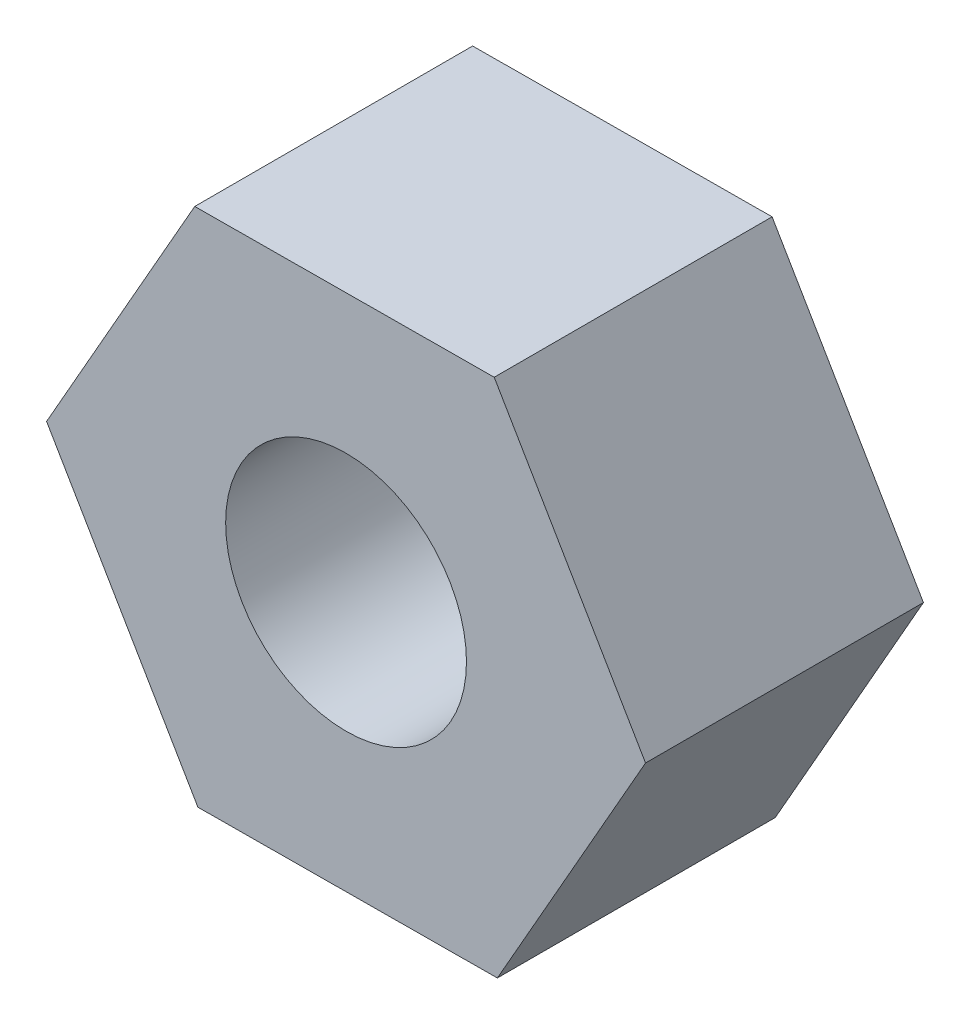
ISO-10303-21;
HEADER;
FILE_DESCRIPTION(('STEP AP214'),'2;1');
FILE_NAME('part.step','',(''),(''),'','','');
FILE_SCHEMA(('AUTOMOTIVE_DESIGN { 1 0 10303 214 1 1 1 1 }'));
ENDSEC;
DATA;
#1=APPLICATION_CONTEXT('core data for automotive mechanical design processes');
#2=APPLICATION_PROTOCOL_DEFINITION('international standard','automotive_design',2000,#1);
#3=PRODUCT_CONTEXT('',#1,'mechanical');
#4=PRODUCT('Part','Part','',(#3));
#5=PRODUCT_RELATED_PRODUCT_CATEGORY('part','',(#4));
#6=PRODUCT_DEFINITION_FORMATION('','',#4);
#7=PRODUCT_DEFINITION_CONTEXT('part definition',#1,'design');
#8=PRODUCT_DEFINITION('design','',#6,#7);
#9=PRODUCT_DEFINITION_SHAPE('','',#8);
#10=(LENGTH_UNIT() NAMED_UNIT(*) SI_UNIT(.MILLI.,.METRE.));
#11=(NAMED_UNIT(*) PLANE_ANGLE_UNIT() SI_UNIT($,.RADIAN.));
#12=(NAMED_UNIT(*) SI_UNIT($,.STERADIAN.) SOLID_ANGLE_UNIT());
#13=UNCERTAINTY_MEASURE_WITH_UNIT(LENGTH_MEASURE(1.E-05),#10,'distance_accuracy_value','');
#14=(GEOMETRIC_REPRESENTATION_CONTEXT(3) GLOBAL_UNCERTAINTY_ASSIGNED_CONTEXT((#13)) GLOBAL_UNIT_ASSIGNED_CONTEXT((#10,
#11,#12)) REPRESENTATION_CONTEXT('',''));
#15=CARTESIAN_POINT('',(0.,0.,0.));
#16=DIRECTION('',(0.,0.,1.));
#17=DIRECTION('',(1.,0.,0.));
#18=AXIS2_PLACEMENT_3D('',#15,#16,#17);
#19=CARTESIAN_POINT('',(0.,0.,15.));
#20=DIRECTION('',(0.,0.,1.));
#21=DIRECTION('',(1.,0.,0.));
#22=AXIS2_PLACEMENT_3D('',#19,#20,#21);
#23=PLANE('',#22);
#24=DIRECTION('',(0.999981476716129,0.00608656098549651,0.));
#25=VECTOR('',#24,1.);
#26=CARTESIAN_POINT('',(-7.99754219293679,-14.0489377607536,15.));
#27=LINE('',#26,#25);
#28=CARTESIAN_POINT('',(-7.99754219293679,-14.0489377607536,15.));
#29=VERTEX_POINT('',#28);
#30=CARTESIAN_POINT('',(8.1679659005307,-13.950543587298,15.));
#31=VERTEX_POINT('',#30);
#32=EDGE_CURVE('E131',#29,#31,#27,.T.);
#33=ORIENTED_EDGE('',*,*,#32,.T.);
#34=DIRECTION('',(0.494719621922941,0.869052642642793,0.));
#35=VECTOR('',#34,1.);
#36=CARTESIAN_POINT('',(8.1679659005307,-13.950543587298,15.));
#37=LINE('',#36,#35);
#38=CARTESIAN_POINT('',(16.1655080934675,0.0983941734556353,15.));
#39=VERTEX_POINT('',#38);
#40=EDGE_CURVE('E89',#31,#39,#37,.T.);
#41=ORIENTED_EDGE('',*,*,#40,.T.);
#42=DIRECTION('',(-0.505261854793188,0.862966081657296,0.));
#43=VECTOR('',#42,1.);
#44=CARTESIAN_POINT('',(16.1655080934675,0.0983941734556353,15.));
#45=LINE('',#44,#43);
#46=CARTESIAN_POINT('',(7.9975421929368,14.0489377607536,15.));
#47=VERTEX_POINT('',#46);
#48=EDGE_CURVE('E102',#39,#47,#45,.T.);
#49=ORIENTED_EDGE('',*,*,#48,.T.);
#50=DIRECTION('',(-0.999981476716129,-0.00608656098549619,0.));
#51=VECTOR('',#50,1.);
#52=CARTESIAN_POINT('',(7.9975421929368,14.0489377607536,15.));
#53=LINE('',#52,#51);
#54=CARTESIAN_POINT('',(-8.1679659005307,13.950543587298,15.));
#55=VERTEX_POINT('',#54);
#56=EDGE_CURVE('E96',#47,#55,#53,.T.);
#57=ORIENTED_EDGE('',*,*,#56,.T.);
#58=DIRECTION('',(-0.494719621922941,-0.869052642642793,0.));
#59=VECTOR('',#58,1.);
#60=CARTESIAN_POINT('',(-8.1679659005307,13.950543587298,15.));
#61=LINE('',#60,#59);
#62=CARTESIAN_POINT('',(-16.1655080934675,-0.0983941734556334,15.));
#63=VERTEX_POINT('',#62);
#64=EDGE_CURVE('E100',#55,#63,#61,.T.);
#65=ORIENTED_EDGE('',*,*,#64,.T.);
#66=DIRECTION('',(0.505261854793187,-0.862966081657297,0.));
#67=VECTOR('',#66,1.);
#68=CARTESIAN_POINT('',(-16.1655080934675,-0.0983941734556334,15.));
#69=LINE('',#68,#67);
#70=EDGE_CURVE('E52',#63,#29,#69,.T.);
#71=ORIENTED_EDGE('',*,*,#70,.T.);
#72=EDGE_LOOP('',(#33,#41,#49,#57,#65,#71));
#73=FACE_BOUND('',#72,.T.);
#74=CARTESIAN_POINT('',(0.,0.,15.));
#75=DIRECTION('',(0.,0.,1.));
#76=DIRECTION('',(1.,0.,0.));
#77=AXIS2_PLACEMENT_3D('',#74,#75,#76);
#78=CIRCLE('',#77,6.5);
#79=CARTESIAN_POINT('',(6.5,0.,15.));
#80=VERTEX_POINT('',#79);
#81=EDGE_CURVE('E124',#80,#80,#78,.T.);
#82=ORIENTED_EDGE('',*,*,#81,.F.);
#83=EDGE_LOOP('',(#82));
#84=FACE_BOUND('',#83,.T.);
#85=ADVANCED_FACE('F35',(#73,#84),#23,.T.);
#86=CARTESIAN_POINT('',(0.,0.,0.));
#87=DIRECTION('',(0.,0.,1.));
#88=DIRECTION('',(1.,0.,0.));
#89=AXIS2_PLACEMENT_3D('',#86,#87,#88);
#90=PLANE('',#89);
#91=DIRECTION('',(0.999981476716129,0.00608656098549651,0.));
#92=VECTOR('',#91,1.);
#93=CARTESIAN_POINT('',(-7.99754219293679,-14.0489377607536,0.));
#94=LINE('',#93,#92);
#95=CARTESIAN_POINT('',(-7.99754219293679,-14.0489377607536,0.));
#96=VERTEX_POINT('',#95);
#97=CARTESIAN_POINT('',(8.1679659005307,-13.950543587298,0.));
#98=VERTEX_POINT('',#97);
#99=EDGE_CURVE('E120',#96,#98,#94,.T.);
#100=ORIENTED_EDGE('',*,*,#99,.F.);
#101=DIRECTION('',(0.505261854793187,-0.862966081657297,0.));
#102=VECTOR('',#101,1.);
#103=CARTESIAN_POINT('',(-16.1655080934675,-0.0983941734556334,0.));
#104=LINE('',#103,#102);
#105=CARTESIAN_POINT('',(-16.1655080934675,-0.0983941734556334,0.));
#106=VERTEX_POINT('',#105);
#107=EDGE_CURVE('E81',#106,#96,#104,.T.);
#108=ORIENTED_EDGE('',*,*,#107,.F.);
#109=DIRECTION('',(-0.494719621922941,-0.869052642642793,0.));
#110=VECTOR('',#109,1.);
#111=CARTESIAN_POINT('',(-8.1679659005307,13.950543587298,0.));
#112=LINE('',#111,#110);
#113=CARTESIAN_POINT('',(-8.1679659005307,13.950543587298,0.));
#114=VERTEX_POINT('',#113);
#115=EDGE_CURVE('E75',#114,#106,#112,.T.);
#116=ORIENTED_EDGE('',*,*,#115,.F.);
#117=DIRECTION('',(-0.999981476716129,-0.00608656098549619,0.));
#118=VECTOR('',#117,1.);
#119=CARTESIAN_POINT('',(7.9975421929368,14.0489377607536,0.));
#120=LINE('',#119,#118);
#121=CARTESIAN_POINT('',(7.9975421929368,14.0489377607536,0.));
#122=VERTEX_POINT('',#121);
#123=EDGE_CURVE('E110',#122,#114,#120,.T.);
#124=ORIENTED_EDGE('',*,*,#123,.F.);
#125=DIRECTION('',(-0.505261854793188,0.862966081657296,0.));
#126=VECTOR('',#125,1.);
#127=CARTESIAN_POINT('',(16.1655080934675,0.0983941734556353,0.));
#128=LINE('',#127,#126);
#129=CARTESIAN_POINT('',(16.1655080934675,0.0983941734556353,0.));
#130=VERTEX_POINT('',#129);
#131=EDGE_CURVE('E126',#130,#122,#128,.T.);
#132=ORIENTED_EDGE('',*,*,#131,.F.);
#133=DIRECTION('',(0.494719621922941,0.869052642642793,0.));
#134=VECTOR('',#133,1.);
#135=CARTESIAN_POINT('',(8.1679659005307,-13.950543587298,0.));
#136=LINE('',#135,#134);
#137=EDGE_CURVE('E123',#98,#130,#136,.T.);
#138=ORIENTED_EDGE('',*,*,#137,.F.);
#139=EDGE_LOOP('',(#100,#108,#116,#124,#132,#138));
#140=FACE_BOUND('',#139,.T.);
#141=CARTESIAN_POINT('',(0.,0.,0.));
#142=DIRECTION('',(0.,0.,1.));
#143=DIRECTION('',(1.,0.,0.));
#144=AXIS2_PLACEMENT_3D('',#141,#142,#143);
#145=CIRCLE('',#144,6.5);
#146=CARTESIAN_POINT('',(6.5,0.,0.));
#147=VERTEX_POINT('',#146);
#148=EDGE_CURVE('E224',#147,#147,#145,.T.);
#149=ORIENTED_EDGE('',*,*,#148,.T.);
#150=EDGE_LOOP('',(#149));
#151=FACE_BOUND('',#150,.T.);
#152=ADVANCED_FACE('F140',(#140,#151),#90,.F.);
#153=CARTESIAN_POINT('',(-7.99754219293679,-14.0489377607536,15.));
#154=DIRECTION('',(-0.00608656098549651,0.999981476716129,0.));
#155=DIRECTION('',(-0.999981476716129,-0.00608656098549651,0.));
#156=AXIS2_PLACEMENT_3D('',#153,#154,#155);
#157=PLANE('',#156);
#158=ORIENTED_EDGE('',*,*,#99,.T.);
#159=DIRECTION('',(0.,0.,-1.));
#160=VECTOR('',#159,1.);
#161=CARTESIAN_POINT('',(8.1679659005307,-13.950543587298,15.));
#162=LINE('',#161,#160);
#163=EDGE_CURVE('E11',#31,#98,#162,.T.);
#164=ORIENTED_EDGE('',*,*,#163,.F.);
#165=ORIENTED_EDGE('',*,*,#32,.F.);
#166=DIRECTION('',(0.,0.,-1.));
#167=VECTOR('',#166,1.);
#168=CARTESIAN_POINT('',(-7.99754219293679,-14.0489377607536,15.));
#169=LINE('',#168,#167);
#170=EDGE_CURVE('E116',#29,#96,#169,.T.);
#171=ORIENTED_EDGE('',*,*,#170,.T.);
#172=EDGE_LOOP('',(#158,#164,#165,#171));
#173=FACE_BOUND('',#172,.T.);
#174=ADVANCED_FACE('F37',(#173),#157,.F.);
#175=CARTESIAN_POINT('',(8.1679659005307,-13.950543587298,15.));
#176=DIRECTION('',(-0.869052642642793,0.494719621922941,0.));
#177=DIRECTION('',(-0.494719621922941,-0.869052642642793,0.));
#178=AXIS2_PLACEMENT_3D('',#175,#176,#177);
#179=PLANE('',#178);
#180=ORIENTED_EDGE('',*,*,#137,.T.);
#181=DIRECTION('',(0.,0.,-1.));
#182=VECTOR('',#181,1.);
#183=CARTESIAN_POINT('',(16.1655080934675,0.0983941734556353,15.));
#184=LINE('',#183,#182);
#185=EDGE_CURVE('E44',#39,#130,#184,.T.);
#186=ORIENTED_EDGE('',*,*,#185,.F.);
#187=ORIENTED_EDGE('',*,*,#40,.F.);
#188=ORIENTED_EDGE('',*,*,#163,.T.);
#189=EDGE_LOOP('',(#180,#186,#187,#188));
#190=FACE_BOUND('',#189,.T.);
#191=ADVANCED_FACE('F165',(#190),#179,.F.);
#192=CARTESIAN_POINT('',(16.1655080934675,0.0983941734556353,15.));
#193=DIRECTION('',(-0.862966081657297,-0.505261854793188,0.));
#194=DIRECTION('',(0.505261854793188,-0.862966081657297,0.));
#195=AXIS2_PLACEMENT_3D('',#192,#193,#194);
#196=PLANE('',#195);
#197=ORIENTED_EDGE('',*,*,#131,.T.);
#198=DIRECTION('',(0.,0.,-1.));
#199=VECTOR('',#198,1.);
#200=CARTESIAN_POINT('',(7.9975421929368,14.0489377607536,15.));
#201=LINE('',#200,#199);
#202=EDGE_CURVE('E111',#47,#122,#201,.T.);
#203=ORIENTED_EDGE('',*,*,#202,.F.);
#204=ORIENTED_EDGE('',*,*,#48,.F.);
#205=ORIENTED_EDGE('',*,*,#185,.T.);
#206=EDGE_LOOP('',(#197,#203,#204,#205));
#207=FACE_BOUND('',#206,.T.);
#208=ADVANCED_FACE('F137',(#207),#196,.F.);
#209=CARTESIAN_POINT('',(7.9975421929368,14.0489377607536,15.));
#210=DIRECTION('',(0.00608656098549619,-0.999981476716129,0.));
#211=DIRECTION('',(0.999981476716129,0.00608656098549619,0.));
#212=AXIS2_PLACEMENT_3D('',#209,#210,#211);
#213=PLANE('',#212);
#214=ORIENTED_EDGE('',*,*,#123,.T.);
#215=DIRECTION('',(0.,0.,-1.));
#216=VECTOR('',#215,1.);
#217=CARTESIAN_POINT('',(-8.1679659005307,13.950543587298,15.));
#218=LINE('',#217,#216);
#219=EDGE_CURVE('E107',#55,#114,#218,.T.);
#220=ORIENTED_EDGE('',*,*,#219,.F.);
#221=ORIENTED_EDGE('',*,*,#56,.F.);
#222=ORIENTED_EDGE('',*,*,#202,.T.);
#223=EDGE_LOOP('',(#214,#220,#221,#222));
#224=FACE_BOUND('',#223,.T.);
#225=ADVANCED_FACE('F108',(#224),#213,.F.);
#226=CARTESIAN_POINT('',(-8.1679659005307,13.950543587298,15.));
#227=DIRECTION('',(0.869052642642793,-0.494719621922941,0.));
#228=DIRECTION('',(0.494719621922941,0.869052642642793,0.));
#229=AXIS2_PLACEMENT_3D('',#226,#227,#228);
#230=PLANE('',#229);
#231=ORIENTED_EDGE('',*,*,#115,.T.);
#232=DIRECTION('',(0.,0.,-1.));
#233=VECTOR('',#232,1.);
#234=CARTESIAN_POINT('',(-16.1655080934675,-0.0983941734556334,15.));
#235=LINE('',#234,#233);
#236=EDGE_CURVE('E112',#63,#106,#235,.T.);
#237=ORIENTED_EDGE('',*,*,#236,.F.);
#238=ORIENTED_EDGE('',*,*,#64,.F.);
#239=ORIENTED_EDGE('',*,*,#219,.T.);
#240=EDGE_LOOP('',(#231,#237,#238,#239));
#241=FACE_BOUND('',#240,.T.);
#242=ADVANCED_FACE('F114',(#241),#230,.F.);
#243=CARTESIAN_POINT('',(-16.1655080934675,-0.0983941734556334,15.));
#244=DIRECTION('',(0.862966081657297,0.505261854793187,0.));
#245=DIRECTION('',(-0.505261854793187,0.862966081657297,0.));
#246=AXIS2_PLACEMENT_3D('',#243,#244,#245);
#247=PLANE('',#246);
#248=ORIENTED_EDGE('',*,*,#107,.T.);
#249=ORIENTED_EDGE('',*,*,#170,.F.);
#250=ORIENTED_EDGE('',*,*,#70,.F.);
#251=ORIENTED_EDGE('',*,*,#236,.T.);
#252=EDGE_LOOP('',(#248,#249,#250,#251));
#253=FACE_BOUND('',#252,.T.);
#254=ADVANCED_FACE('F145',(#253),#247,.F.);
#255=CARTESIAN_POINT('',(0.,0.,15.));
#256=DIRECTION('',(0.,0.,-1.));
#257=DIRECTION('',(-1.,0.,0.));
#258=AXIS2_PLACEMENT_3D('',#255,#256,#257);
#259=CYLINDRICAL_SURFACE('',#258,6.5);
#260=ORIENTED_EDGE('',*,*,#81,.T.);
#261=EDGE_LOOP('',(#260));
#262=FACE_BOUND('',#261,.T.);
#263=ORIENTED_EDGE('',*,*,#148,.F.);
#264=EDGE_LOOP('',(#263));
#265=FACE_BOUND('',#264,.T.);
#266=ADVANCED_FACE('F147',(#262,#265),#259,.F.);
#267=CLOSED_SHELL('',(#85,#152,#174,#191,#208,#225,#242,#254,#266));
#268=MANIFOLD_SOLID_BREP('B2',#267);
#269=ADVANCED_BREP_SHAPE_REPRESENTATION('',(#18,#268),#14);
#270=SHAPE_DEFINITION_REPRESENTATION(#9,#269);
ENDSEC;
END-ISO-10303-21;
